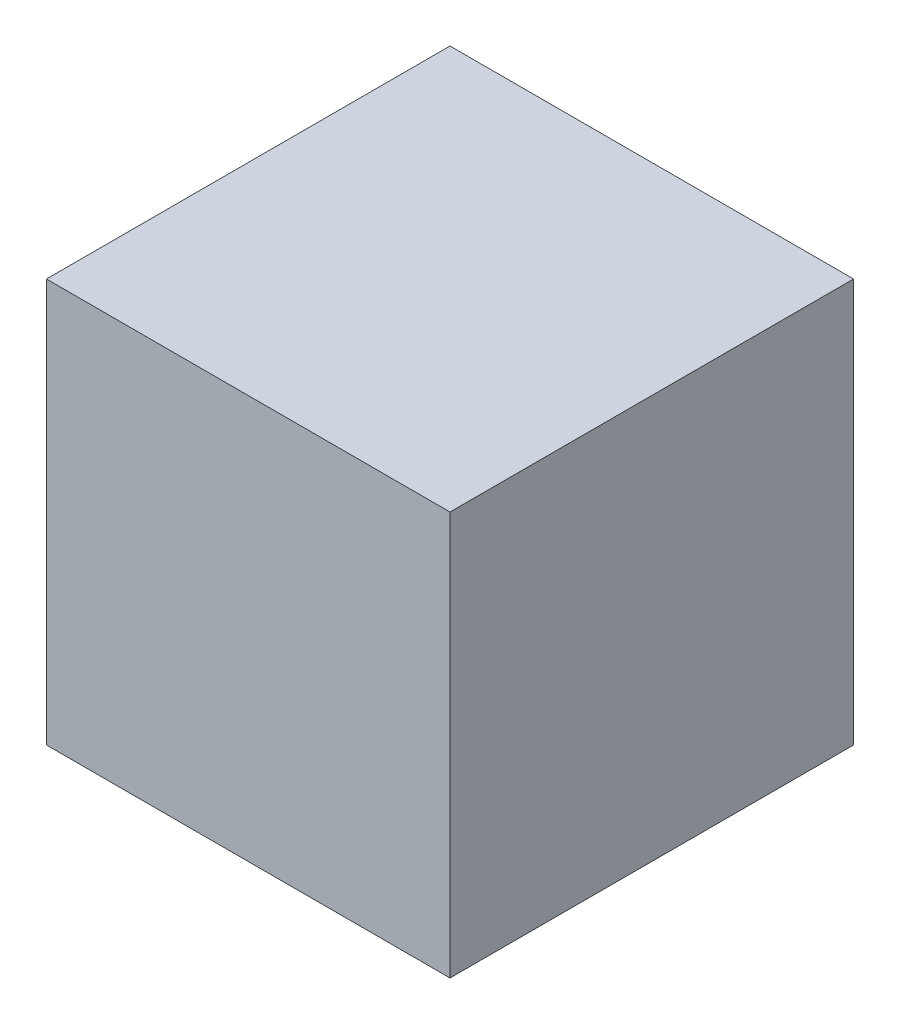
ISO-10303-21;
HEADER;
FILE_DESCRIPTION(('STEP AP214'),'2;1');
FILE_NAME('part.step','',(''),(''),'','','');
FILE_SCHEMA(('AUTOMOTIVE_DESIGN { 1 0 10303 214 1 1 1 1 }'));
ENDSEC;
DATA;
#1=APPLICATION_CONTEXT('core data for automotive mechanical design processes');
#2=APPLICATION_PROTOCOL_DEFINITION('international standard','automotive_design',2000,#1);
#3=PRODUCT_CONTEXT('',#1,'mechanical');
#4=PRODUCT('Part','Part','',(#3));
#5=PRODUCT_RELATED_PRODUCT_CATEGORY('part','',(#4));
#6=PRODUCT_DEFINITION_FORMATION('','',#4);
#7=PRODUCT_DEFINITION_CONTEXT('part definition',#1,'design');
#8=PRODUCT_DEFINITION('design','',#6,#7);
#9=PRODUCT_DEFINITION_SHAPE('','',#8);
#10=(LENGTH_UNIT() NAMED_UNIT(*) SI_UNIT(.MILLI.,.METRE.));
#11=(NAMED_UNIT(*) PLANE_ANGLE_UNIT() SI_UNIT($,.RADIAN.));
#12=(NAMED_UNIT(*) SI_UNIT($,.STERADIAN.) SOLID_ANGLE_UNIT());
#13=UNCERTAINTY_MEASURE_WITH_UNIT(LENGTH_MEASURE(1.E-05),#10,'distance_accuracy_value','');
#14=(GEOMETRIC_REPRESENTATION_CONTEXT(3) GLOBAL_UNCERTAINTY_ASSIGNED_CONTEXT((#13)) GLOBAL_UNIT_ASSIGNED_CONTEXT((#10,
#11,#12)) REPRESENTATION_CONTEXT('',''));
#15=CARTESIAN_POINT('',(0.,0.,0.));
#16=DIRECTION('',(0.,0.,1.));
#17=DIRECTION('',(1.,0.,0.));
#18=AXIS2_PLACEMENT_3D('',#15,#16,#17);
#19=CARTESIAN_POINT('',(0.,25.,0.));
#20=DIRECTION('',(1.,0.,0.));
#21=DIRECTION('',(0.,0.,-1.));
#22=AXIS2_PLACEMENT_3D('',#19,#20,#21);
#23=PLANE('',#22);
#24=DIRECTION('',(0.,0.,1.));
#25=VECTOR('',#24,1.);
#26=CARTESIAN_POINT('',(0.,0.,0.));
#27=LINE('',#26,#25);
#28=CARTESIAN_POINT('',(0.,0.,-25.));
#29=VERTEX_POINT('',#28);
#30=CARTESIAN_POINT('',(0.,0.,0.));
#31=VERTEX_POINT('',#30);
#32=EDGE_CURVE('E100',#29,#31,#27,.T.);
#33=ORIENTED_EDGE('',*,*,#32,.T.);
#34=DIRECTION('',(0.,-1.,0.));
#35=VECTOR('',#34,1.);
#36=CARTESIAN_POINT('',(0.,25.,0.));
#37=LINE('',#36,#35);
#38=CARTESIAN_POINT('',(0.,25.,0.));
#39=VERTEX_POINT('',#38);
#40=EDGE_CURVE('E11',#39,#31,#37,.T.);
#41=ORIENTED_EDGE('',*,*,#40,.F.);
#42=DIRECTION('',(0.,0.,1.));
#43=VECTOR('',#42,1.);
#44=CARTESIAN_POINT('',(0.,25.,0.));
#45=LINE('',#44,#43);
#46=CARTESIAN_POINT('',(0.,25.,-25.));
#47=VERTEX_POINT('',#46);
#48=EDGE_CURVE('E88',#47,#39,#45,.T.);
#49=ORIENTED_EDGE('',*,*,#48,.F.);
#50=DIRECTION('',(0.,-1.,0.));
#51=VECTOR('',#50,1.);
#52=CARTESIAN_POINT('',(0.,25.,-25.));
#53=LINE('',#52,#51);
#54=EDGE_CURVE('E96',#47,#29,#53,.T.);
#55=ORIENTED_EDGE('',*,*,#54,.T.);
#56=EDGE_LOOP('',(#33,#41,#49,#55));
#57=FACE_BOUND('',#56,.T.);
#58=ADVANCED_FACE('F37',(#57),#23,.F.);
#59=CARTESIAN_POINT('',(0.,25.,0.));
#60=DIRECTION('',(0.,0.,-1.));
#61=DIRECTION('',(-1.,0.,0.));
#62=AXIS2_PLACEMENT_3D('',#59,#60,#61);
#63=PLANE('',#62);
#64=DIRECTION('',(1.,0.,0.));
#65=VECTOR('',#64,1.);
#66=CARTESIAN_POINT('',(0.,0.,0.));
#67=LINE('',#66,#65);
#68=CARTESIAN_POINT('',(25.,0.,0.));
#69=VERTEX_POINT('',#68);
#70=EDGE_CURVE('E92',#31,#69,#67,.T.);
#71=ORIENTED_EDGE('',*,*,#70,.T.);
#72=DIRECTION('',(0.,-1.,0.));
#73=VECTOR('',#72,1.);
#74=CARTESIAN_POINT('',(25.,25.,0.));
#75=LINE('',#74,#73);
#76=CARTESIAN_POINT('',(25.,25.,0.));
#77=VERTEX_POINT('',#76);
#78=EDGE_CURVE('E45',#77,#69,#75,.T.);
#79=ORIENTED_EDGE('',*,*,#78,.F.);
#80=DIRECTION('',(1.,0.,0.));
#81=VECTOR('',#80,1.);
#82=CARTESIAN_POINT('',(0.,25.,0.));
#83=LINE('',#82,#81);
#84=EDGE_CURVE('E83',#39,#77,#83,.T.);
#85=ORIENTED_EDGE('',*,*,#84,.F.);
#86=ORIENTED_EDGE('',*,*,#40,.T.);
#87=EDGE_LOOP('',(#71,#79,#85,#86));
#88=FACE_BOUND('',#87,.T.);
#89=ADVANCED_FACE('F91',(#88),#63,.F.);
#90=CARTESIAN_POINT('',(25.,25.,0.));
#91=DIRECTION('',(-1.,0.,0.));
#92=DIRECTION('',(0.,0.,1.));
#93=AXIS2_PLACEMENT_3D('',#90,#91,#92);
#94=PLANE('',#93);
#95=DIRECTION('',(0.,0.,-1.));
#96=VECTOR('',#95,1.);
#97=CARTESIAN_POINT('',(25.,0.,0.));
#98=LINE('',#97,#96);
#99=CARTESIAN_POINT('',(25.,0.,-25.));
#100=VERTEX_POINT('',#99);
#101=EDGE_CURVE('E70',#69,#100,#98,.T.);
#102=ORIENTED_EDGE('',*,*,#101,.T.);
#103=DIRECTION('',(0.,-1.,0.));
#104=VECTOR('',#103,1.);
#105=CARTESIAN_POINT('',(25.,25.,-25.));
#106=LINE('',#105,#104);
#107=CARTESIAN_POINT('',(25.,25.,-25.));
#108=VERTEX_POINT('',#107);
#109=EDGE_CURVE('E93',#108,#100,#106,.T.);
#110=ORIENTED_EDGE('',*,*,#109,.F.);
#111=DIRECTION('',(0.,0.,-1.));
#112=VECTOR('',#111,1.);
#113=CARTESIAN_POINT('',(25.,25.,0.));
#114=LINE('',#113,#112);
#115=EDGE_CURVE('E86',#77,#108,#114,.T.);
#116=ORIENTED_EDGE('',*,*,#115,.F.);
#117=ORIENTED_EDGE('',*,*,#78,.T.);
#118=EDGE_LOOP('',(#102,#110,#116,#117));
#119=FACE_BOUND('',#118,.T.);
#120=ADVANCED_FACE('F94',(#119),#94,.F.);
#121=CARTESIAN_POINT('',(0.,25.,-25.));
#122=DIRECTION('',(0.,0.,1.));
#123=DIRECTION('',(1.,0.,0.));
#124=AXIS2_PLACEMENT_3D('',#121,#122,#123);
#125=PLANE('',#124);
#126=DIRECTION('',(-1.,0.,0.));
#127=VECTOR('',#126,1.);
#128=CARTESIAN_POINT('',(0.,0.,-25.));
#129=LINE('',#128,#127);
#130=EDGE_CURVE('E76',#100,#29,#129,.T.);
#131=ORIENTED_EDGE('',*,*,#130,.T.);
#132=ORIENTED_EDGE('',*,*,#54,.F.);
#133=DIRECTION('',(-1.,0.,0.));
#134=VECTOR('',#133,1.);
#135=CARTESIAN_POINT('',(0.,25.,-25.));
#136=LINE('',#135,#134);
#137=EDGE_CURVE('E53',#108,#47,#136,.T.);
#138=ORIENTED_EDGE('',*,*,#137,.F.);
#139=ORIENTED_EDGE('',*,*,#109,.T.);
#140=EDGE_LOOP('',(#131,#132,#138,#139));
#141=FACE_BOUND('',#140,.T.);
#142=ADVANCED_FACE('F107',(#141),#125,.F.);
#143=CARTESIAN_POINT('',(0.,25.,0.));
#144=DIRECTION('',(0.,-1.,0.));
#145=DIRECTION('',(0.,0.,-1.));
#146=AXIS2_PLACEMENT_3D('',#143,#144,#145);
#147=PLANE('',#146);
#148=ORIENTED_EDGE('',*,*,#48,.T.);
#149=ORIENTED_EDGE('',*,*,#84,.T.);
#150=ORIENTED_EDGE('',*,*,#115,.T.);
#151=ORIENTED_EDGE('',*,*,#137,.T.);
#152=EDGE_LOOP('',(#148,#149,#150,#151));
#153=FACE_BOUND('',#152,.T.);
#154=ADVANCED_FACE('F84',(#153),#147,.F.);
#155=CARTESIAN_POINT('',(0.,0.,0.));
#156=DIRECTION('',(0.,-1.,0.));
#157=DIRECTION('',(0.,0.,-1.));
#158=AXIS2_PLACEMENT_3D('',#155,#156,#157);
#159=PLANE('',#158);
#160=ORIENTED_EDGE('',*,*,#32,.F.);
#161=ORIENTED_EDGE('',*,*,#130,.F.);
#162=ORIENTED_EDGE('',*,*,#101,.F.);
#163=ORIENTED_EDGE('',*,*,#70,.F.);
#164=EDGE_LOOP('',(#160,#161,#162,#163));
#165=FACE_BOUND('',#164,.T.);
#166=ADVANCED_FACE('F110',(#165),#159,.T.);
#167=CLOSED_SHELL('',(#58,#89,#120,#142,#154,#166));
#168=MANIFOLD_SOLID_BREP('B2',#167);
#169=ADVANCED_BREP_SHAPE_REPRESENTATION('',(#18,#168),#14);
#170=SHAPE_DEFINITION_REPRESENTATION(#9,#169);
ENDSEC;
END-ISO-10303-21;
